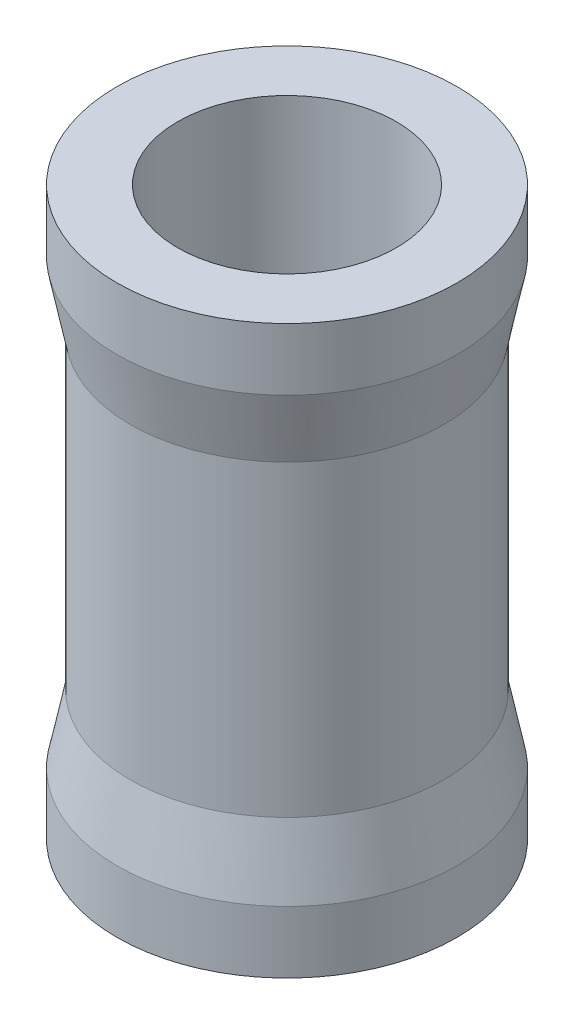
ISO-10303-21;
HEADER;
FILE_DESCRIPTION(('STEP AP214'),'2;1');
FILE_NAME('part.step','',(''),(''),'','','');
FILE_SCHEMA(('AUTOMOTIVE_DESIGN { 1 0 10303 214 1 1 1 1 }'));
ENDSEC;
DATA;
#1=APPLICATION_CONTEXT('core data for automotive mechanical design processes');
#2=APPLICATION_PROTOCOL_DEFINITION('international standard','automotive_design',2000,#1);
#3=PRODUCT_CONTEXT('',#1,'mechanical');
#4=PRODUCT('Part','Part','',(#3));
#5=PRODUCT_RELATED_PRODUCT_CATEGORY('part','',(#4));
#6=PRODUCT_DEFINITION_FORMATION('','',#4);
#7=PRODUCT_DEFINITION_CONTEXT('part definition',#1,'design');
#8=PRODUCT_DEFINITION('design','',#6,#7);
#9=PRODUCT_DEFINITION_SHAPE('','',#8);
#10=(LENGTH_UNIT() NAMED_UNIT(*) SI_UNIT(.MILLI.,.METRE.));
#11=(NAMED_UNIT(*) PLANE_ANGLE_UNIT() SI_UNIT($,.RADIAN.));
#12=(NAMED_UNIT(*) SI_UNIT($,.STERADIAN.) SOLID_ANGLE_UNIT());
#13=UNCERTAINTY_MEASURE_WITH_UNIT(LENGTH_MEASURE(1.E-05),#10,'distance_accuracy_value','');
#14=(GEOMETRIC_REPRESENTATION_CONTEXT(3) GLOBAL_UNCERTAINTY_ASSIGNED_CONTEXT((#13)) GLOBAL_UNIT_ASSIGNED_CONTEXT((#10,
#11,#12)) REPRESENTATION_CONTEXT('',''));
#15=CARTESIAN_POINT('',(0.,0.,0.));
#16=DIRECTION('',(0.,0.,1.));
#17=DIRECTION('',(1.,0.,0.));
#18=AXIS2_PLACEMENT_3D('',#15,#16,#17);
#19=CARTESIAN_POINT('',(0.,10.5,0.));
#20=DIRECTION('',(0.,1.,0.));
#21=DIRECTION('',(-1.,0.,0.));
#22=AXIS2_PLACEMENT_3D('',#19,#20,#21);
#23=CYLINDRICAL_SURFACE('',#22,5.8);
#24=CARTESIAN_POINT('',(0.,5.7,0.));
#25=DIRECTION('',(0.,1.,0.));
#26=DIRECTION('',(-1.,0.,0.));
#27=AXIS2_PLACEMENT_3D('',#24,#25,#26);
#28=CIRCLE('',#27,5.8);
#29=CARTESIAN_POINT('',(-5.8,5.7,0.));
#30=VERTEX_POINT('',#29);
#31=EDGE_CURVE('E10',#30,#30,#28,.T.);
#32=ORIENTED_EDGE('',*,*,#31,.F.);
#33=EDGE_LOOP('',(#32));
#34=FACE_BOUND('',#33,.T.);
#35=CARTESIAN_POINT('',(0.,-5.7,0.));
#36=DIRECTION('',(0.,1.,0.));
#37=DIRECTION('',(-1.,0.,0.));
#38=AXIS2_PLACEMENT_3D('',#35,#36,#37);
#39=CIRCLE('',#38,5.8);
#40=CARTESIAN_POINT('',(-5.8,-5.7,0.));
#41=VERTEX_POINT('',#40);
#42=EDGE_CURVE('E72',#41,#41,#39,.T.);
#43=ORIENTED_EDGE('',*,*,#42,.T.);
#44=EDGE_LOOP('',(#43));
#45=FACE_BOUND('',#44,.T.);
#46=ADVANCED_FACE('F37',(#34,#45),#23,.T.);
#47=CARTESIAN_POINT('',(0.,5.7,0.));
#48=DIRECTION('',(0.,1.,0.));
#49=DIRECTION('',(-1.,0.,0.));
#50=AXIS2_PLACEMENT_3D('',#47,#48,#49);
#51=CONICAL_SURFACE('',#50,5.8,0.19739555984988);
#52=CARTESIAN_POINT('',(0.,8.2,0.));
#53=DIRECTION('',(0.,1.,0.));
#54=DIRECTION('',(-1.,0.,0.));
#55=AXIS2_PLACEMENT_3D('',#52,#53,#54);
#56=CIRCLE('',#55,6.3);
#57=CARTESIAN_POINT('',(-6.3,8.2,0.));
#58=VERTEX_POINT('',#57);
#59=EDGE_CURVE('E44',#58,#58,#56,.T.);
#60=ORIENTED_EDGE('',*,*,#59,.F.);
#61=EDGE_LOOP('',(#60));
#62=FACE_BOUND('',#61,.T.);
#63=ORIENTED_EDGE('',*,*,#31,.T.);
#64=EDGE_LOOP('',(#63));
#65=FACE_BOUND('',#64,.T.);
#66=ADVANCED_FACE('F110',(#62,#65),#51,.T.);
#67=CARTESIAN_POINT('',(0.,10.5,0.));
#68=DIRECTION('',(0.,1.,0.));
#69=DIRECTION('',(-1.,0.,0.));
#70=AXIS2_PLACEMENT_3D('',#67,#68,#69);
#71=CYLINDRICAL_SURFACE('',#70,6.3);
#72=CARTESIAN_POINT('',(0.,10.5,0.));
#73=DIRECTION('',(0.,1.,0.));
#74=DIRECTION('',(-1.,0.,0.));
#75=AXIS2_PLACEMENT_3D('',#72,#73,#74);
#76=CIRCLE('',#75,6.3);
#77=CARTESIAN_POINT('',(-6.3,10.5,0.));
#78=VERTEX_POINT('',#77);
#79=EDGE_CURVE('E49',#78,#78,#76,.T.);
#80=ORIENTED_EDGE('',*,*,#79,.F.);
#81=EDGE_LOOP('',(#80));
#82=FACE_BOUND('',#81,.T.);
#83=ORIENTED_EDGE('',*,*,#59,.T.);
#84=EDGE_LOOP('',(#83));
#85=FACE_BOUND('',#84,.T.);
#86=ADVANCED_FACE('F105',(#82,#85),#71,.T.);
#87=CARTESIAN_POINT('',(4.05,10.5,0.));
#88=DIRECTION('',(0.,-1.,0.));
#89=DIRECTION('',(1.,0.,0.));
#90=AXIS2_PLACEMENT_3D('',#87,#88,#89);
#91=PLANE('',#90);
#92=CARTESIAN_POINT('',(0.,10.5,0.));
#93=DIRECTION('',(0.,1.,0.));
#94=DIRECTION('',(-1.,0.,0.));
#95=AXIS2_PLACEMENT_3D('',#92,#93,#94);
#96=CIRCLE('',#95,4.05);
#97=CARTESIAN_POINT('',(-4.05,10.5,0.));
#98=VERTEX_POINT('',#97);
#99=EDGE_CURVE('E54',#98,#98,#96,.T.);
#100=ORIENTED_EDGE('',*,*,#99,.F.);
#101=EDGE_LOOP('',(#100));
#102=FACE_BOUND('',#101,.T.);
#103=ORIENTED_EDGE('',*,*,#79,.T.);
#104=EDGE_LOOP('',(#103));
#105=FACE_BOUND('',#104,.T.);
#106=ADVANCED_FACE('F99',(#102,#105),#91,.F.);
#107=CARTESIAN_POINT('',(0.,10.5,0.));
#108=DIRECTION('',(0.,1.,0.));
#109=DIRECTION('',(-1.,0.,0.));
#110=AXIS2_PLACEMENT_3D('',#107,#108,#109);
#111=CYLINDRICAL_SURFACE('',#110,4.05);
#112=CARTESIAN_POINT('',(0.,-10.5,0.));
#113=DIRECTION('',(0.,1.,0.));
#114=DIRECTION('',(-1.,0.,0.));
#115=AXIS2_PLACEMENT_3D('',#112,#113,#114);
#116=CIRCLE('',#115,4.05);
#117=CARTESIAN_POINT('',(-4.05,-10.5,0.));
#118=VERTEX_POINT('',#117);
#119=EDGE_CURVE('E60',#118,#118,#116,.T.);
#120=ORIENTED_EDGE('',*,*,#119,.F.);
#121=EDGE_LOOP('',(#120));
#122=FACE_BOUND('',#121,.T.);
#123=ORIENTED_EDGE('',*,*,#99,.T.);
#124=EDGE_LOOP('',(#123));
#125=FACE_BOUND('',#124,.T.);
#126=ADVANCED_FACE('F93',(#122,#125),#111,.F.);
#127=CARTESIAN_POINT('',(4.05,-10.5,0.));
#128=DIRECTION('',(0.,1.,0.));
#129=DIRECTION('',(-1.,0.,0.));
#130=AXIS2_PLACEMENT_3D('',#127,#128,#129);
#131=PLANE('',#130);
#132=CARTESIAN_POINT('',(0.,-10.5,0.));
#133=DIRECTION('',(0.,1.,0.));
#134=DIRECTION('',(-1.,0.,0.));
#135=AXIS2_PLACEMENT_3D('',#132,#133,#134);
#136=CIRCLE('',#135,6.3);
#137=CARTESIAN_POINT('',(-6.3,-10.5,0.));
#138=VERTEX_POINT('',#137);
#139=EDGE_CURVE('E64',#138,#138,#136,.T.);
#140=ORIENTED_EDGE('',*,*,#139,.F.);
#141=EDGE_LOOP('',(#140));
#142=FACE_BOUND('',#141,.T.);
#143=ORIENTED_EDGE('',*,*,#119,.T.);
#144=EDGE_LOOP('',(#143));
#145=FACE_BOUND('',#144,.T.);
#146=ADVANCED_FACE('F87',(#142,#145),#131,.F.);
#147=CARTESIAN_POINT('',(0.,10.5,0.));
#148=DIRECTION('',(0.,1.,0.));
#149=DIRECTION('',(-1.,0.,0.));
#150=AXIS2_PLACEMENT_3D('',#147,#148,#149);
#151=CYLINDRICAL_SURFACE('',#150,6.3);
#152=CARTESIAN_POINT('',(0.,-8.2,0.));
#153=DIRECTION('',(0.,1.,0.));
#154=DIRECTION('',(-1.,0.,0.));
#155=AXIS2_PLACEMENT_3D('',#152,#153,#154);
#156=CIRCLE('',#155,6.3);
#157=CARTESIAN_POINT('',(-6.3,-8.2,0.));
#158=VERTEX_POINT('',#157);
#159=EDGE_CURVE('E68',#158,#158,#156,.T.);
#160=ORIENTED_EDGE('',*,*,#159,.F.);
#161=EDGE_LOOP('',(#160));
#162=FACE_BOUND('',#161,.T.);
#163=ORIENTED_EDGE('',*,*,#139,.T.);
#164=EDGE_LOOP('',(#163));
#165=FACE_BOUND('',#164,.T.);
#166=ADVANCED_FACE('F81',(#162,#165),#151,.T.);
#167=CARTESIAN_POINT('',(0.,-8.2,0.));
#168=DIRECTION('',(0.,-1.,0.));
#169=DIRECTION('',(1.,0.,0.));
#170=AXIS2_PLACEMENT_3D('',#167,#168,#169);
#171=CONICAL_SURFACE('',#170,6.3,0.19739555984988);
#172=ORIENTED_EDGE('',*,*,#42,.F.);
#173=EDGE_LOOP('',(#172));
#174=FACE_BOUND('',#173,.T.);
#175=ORIENTED_EDGE('',*,*,#159,.T.);
#176=EDGE_LOOP('',(#175));
#177=FACE_BOUND('',#176,.T.);
#178=ADVANCED_FACE('F78',(#174,#177),#171,.T.);
#179=CLOSED_SHELL('',(#46,#66,#86,#106,#126,#146,#166,#178));
#180=MANIFOLD_SOLID_BREP('B2',#179);
#181=ADVANCED_BREP_SHAPE_REPRESENTATION('',(#18,#180),#14);
#182=SHAPE_DEFINITION_REPRESENTATION(#9,#181);
ENDSEC;
END-ISO-10303-21;
